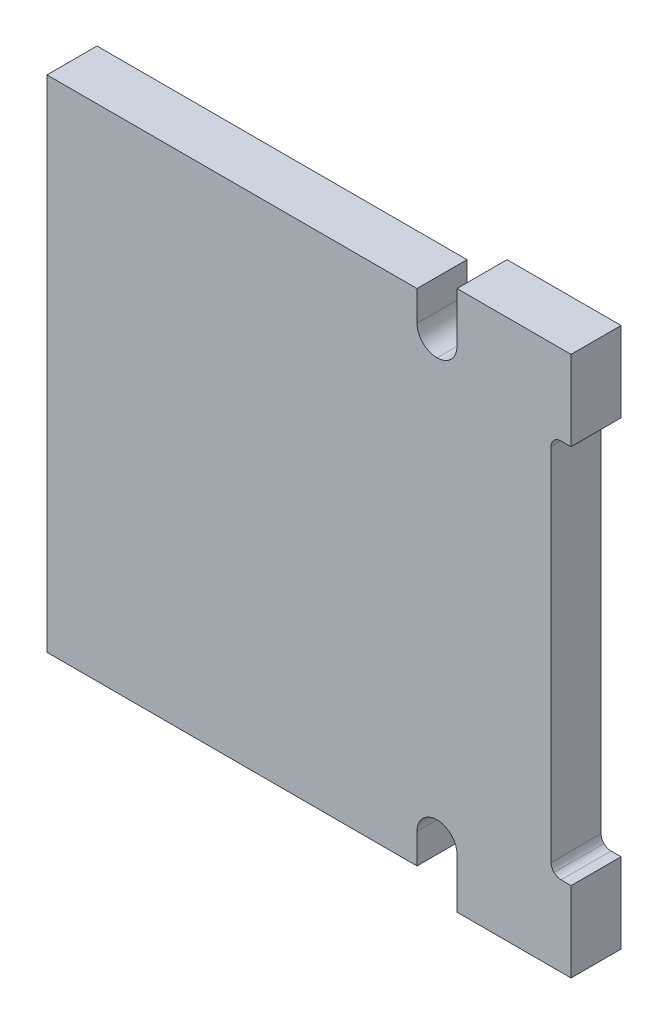
ISO-10303-21;
HEADER;
FILE_DESCRIPTION(('STEP AP214'),'2;1');
FILE_NAME('part.step','',(''),(''),'','','');
FILE_SCHEMA(('AUTOMOTIVE_DESIGN { 1 0 10303 214 1 1 1 1 }'));
ENDSEC;
DATA;
#1=APPLICATION_CONTEXT('core data for automotive mechanical design processes');
#2=APPLICATION_PROTOCOL_DEFINITION('international standard','automotive_design',2000,#1);
#3=PRODUCT_CONTEXT('',#1,'mechanical');
#4=PRODUCT('Part','Part','',(#3));
#5=PRODUCT_RELATED_PRODUCT_CATEGORY('part','',(#4));
#6=PRODUCT_DEFINITION_FORMATION('','',#4);
#7=PRODUCT_DEFINITION_CONTEXT('part definition',#1,'design');
#8=PRODUCT_DEFINITION('design','',#6,#7);
#9=PRODUCT_DEFINITION_SHAPE('','',#8);
#10=(LENGTH_UNIT() NAMED_UNIT(*) SI_UNIT(.MILLI.,.METRE.));
#11=(NAMED_UNIT(*) PLANE_ANGLE_UNIT() SI_UNIT($,.RADIAN.));
#12=(NAMED_UNIT(*) SI_UNIT($,.STERADIAN.) SOLID_ANGLE_UNIT());
#13=UNCERTAINTY_MEASURE_WITH_UNIT(LENGTH_MEASURE(1.E-05),#10,'distance_accuracy_value','');
#14=(GEOMETRIC_REPRESENTATION_CONTEXT(3) GLOBAL_UNCERTAINTY_ASSIGNED_CONTEXT((#13)) GLOBAL_UNIT_ASSIGNED_CONTEXT((#10,
#11,#12)) REPRESENTATION_CONTEXT('',''));
#15=CARTESIAN_POINT('',(0.,0.,0.));
#16=DIRECTION('',(0.,0.,1.));
#17=DIRECTION('',(1.,0.,0.));
#18=AXIS2_PLACEMENT_3D('',#15,#16,#17);
#19=CARTESIAN_POINT('',(2.5335472746525,0.,0.5));
#20=DIRECTION('',(0.,0.,1.));
#21=DIRECTION('',(1.,0.,0.));
#22=AXIS2_PLACEMENT_3D('',#19,#20,#21);
#23=PLANE('',#22);
#24=DIRECTION('',(0.,1.,0.));
#25=VECTOR('',#24,1.);
#26=CARTESIAN_POINT('',(-0.249999999999971,2.5,0.5));
#27=LINE('',#26,#25);
#28=CARTESIAN_POINT('',(-0.249999999999972,-2.50000000000011,0.5));
#29=VERTEX_POINT('',#28);
#30=CARTESIAN_POINT('',(-0.249999999999971,2.5,0.5));
#31=VERTEX_POINT('',#30);
#32=EDGE_CURVE('E316',#29,#31,#27,.T.);
#33=ORIENTED_EDGE('',*,*,#32,.F.);
#34=DIRECTION('',(-1.,0.,0.));
#35=VECTOR('',#34,1.);
#36=CARTESIAN_POINT('',(-0.249999999999972,-2.50000000000011,0.5));
#37=LINE('',#36,#35);
#38=CARTESIAN_POINT('',(3.45,-2.50000000000011,0.5));
#39=VERTEX_POINT('',#38);
#40=EDGE_CURVE('E11',#39,#29,#37,.T.);
#41=ORIENTED_EDGE('',*,*,#40,.F.);
#42=DIRECTION('',(0.,-1.,0.));
#43=VECTOR('',#42,1.);
#44=CARTESIAN_POINT('',(3.45000000000005,2.49999999999994,0.5));
#45=LINE('',#44,#43);
#46=CARTESIAN_POINT('',(3.45,-2.20000000000005,0.5));
#47=VERTEX_POINT('',#46);
#48=EDGE_CURVE('E310',#47,#39,#45,.T.);
#49=ORIENTED_EDGE('',*,*,#48,.F.);
#50=CARTESIAN_POINT('',(3.65,-2.20000000000005,0.5));
#51=DIRECTION('',(0.,0.,1.));
#52=DIRECTION('',(0.,1.,0.));
#53=AXIS2_PLACEMENT_3D('',#50,#51,#52);
#54=CIRCLE('',#53,0.199999999999989);
#55=CARTESIAN_POINT('',(3.65,-2.00000000000006,0.5));
#56=VERTEX_POINT('',#55);
#57=EDGE_CURVE('E266',#56,#47,#54,.T.);
#58=ORIENTED_EDGE('',*,*,#57,.F.);
#59=CARTESIAN_POINT('',(3.65,-2.20000000000005,0.5));
#60=DIRECTION('',(0.,0.,1.));
#61=DIRECTION('',(0.,1.,0.));
#62=AXIS2_PLACEMENT_3D('',#59,#60,#61);
#63=CIRCLE('',#62,0.199999999999989);
#64=CARTESIAN_POINT('',(3.85,-2.20000000000004,0.5));
#65=VERTEX_POINT('',#64);
#66=EDGE_CURVE('E46',#65,#56,#63,.T.);
#67=ORIENTED_EDGE('',*,*,#66,.F.);
#68=DIRECTION('',(0.,1.,0.));
#69=VECTOR('',#68,1.);
#70=CARTESIAN_POINT('',(3.85,0.999999999999772,0.5));
#71=LINE('',#70,#69);
#72=CARTESIAN_POINT('',(3.85,-2.7,0.5));
#73=VERTEX_POINT('',#72);
#74=EDGE_CURVE('E490',#73,#65,#71,.T.);
#75=ORIENTED_EDGE('',*,*,#74,.F.);
#76=DIRECTION('',(-1.,0.,0.));
#77=VECTOR('',#76,1.);
#78=CARTESIAN_POINT('',(3.85,-2.7,0.5));
#79=LINE('',#78,#77);
#80=CARTESIAN_POINT('',(4.99,-2.69999999999993,0.5));
#81=VERTEX_POINT('',#80);
#82=EDGE_CURVE('E353',#81,#73,#79,.T.);
#83=ORIENTED_EDGE('',*,*,#82,.F.);
#84=DIRECTION('',(0.,-1.,0.));
#85=VECTOR('',#84,1.);
#86=CARTESIAN_POINT('',(4.99,2.70000000000004,0.5));
#87=LINE('',#86,#85);
#88=CARTESIAN_POINT('',(4.99,-1.90000000000004,0.5));
#89=VERTEX_POINT('',#88);
#90=EDGE_CURVE('E354',#89,#81,#87,.T.);
#91=ORIENTED_EDGE('',*,*,#90,.F.);
#92=DIRECTION('',(1.,-2.84400785257291E-13,0.));
#93=VECTOR('',#92,1.);
#94=CARTESIAN_POINT('',(4.99,-1.90000000000004,0.5));
#95=LINE('',#94,#93);
#96=CARTESIAN_POINT('',(4.89,-1.9,0.5));
#97=VERTEX_POINT('',#96);
#98=EDGE_CURVE('E452',#97,#89,#95,.T.);
#99=ORIENTED_EDGE('',*,*,#98,.F.);
#100=CARTESIAN_POINT('',(4.89,-1.8,0.5));
#101=DIRECTION('',(0.,0.,1.));
#102=DIRECTION('',(-0.707106781186449,-0.707106781186646,0.));
#103=AXIS2_PLACEMENT_3D('',#100,#101,#102);
#104=CIRCLE('',#103,0.100000000000009);
#105=CARTESIAN_POINT('',(4.81928932188135,-1.87071067811867,0.5));
#106=VERTEX_POINT('',#105);
#107=EDGE_CURVE('E330',#106,#97,#104,.T.);
#108=ORIENTED_EDGE('',*,*,#107,.F.);
#109=CARTESIAN_POINT('',(4.89,-1.8,0.5));
#110=DIRECTION('',(0.,0.,1.));
#111=DIRECTION('',(-0.707106781186449,-0.707106781186646,0.));
#112=AXIS2_PLACEMENT_3D('',#109,#110,#111);
#113=CIRCLE('',#112,0.100000000000009);
#114=CARTESIAN_POINT('',(4.79,-1.8,0.5));
#115=VERTEX_POINT('',#114);
#116=EDGE_CURVE('E457',#115,#106,#113,.T.);
#117=ORIENTED_EDGE('',*,*,#116,.F.);
#118=DIRECTION('',(0.,-1.,0.));
#119=VECTOR('',#118,1.);
#120=CARTESIAN_POINT('',(4.79,-1.8,0.5));
#121=LINE('',#120,#119);
#122=CARTESIAN_POINT('',(4.79,1.79999999999995,0.5));
#123=VERTEX_POINT('',#122);
#124=EDGE_CURVE('E284',#123,#115,#121,.T.);
#125=ORIENTED_EDGE('',*,*,#124,.F.);
#126=CARTESIAN_POINT('',(4.89,1.79999999999995,0.5));
#127=DIRECTION('',(0.,0.,1.));
#128=DIRECTION('',(-0.707106781186547,0.707106781186549,0.));
#129=AXIS2_PLACEMENT_3D('',#126,#127,#128);
#130=CIRCLE('',#129,0.0999999999999942);
#131=CARTESIAN_POINT('',(4.81928932188135,1.8707106781186,0.5));
#132=VERTEX_POINT('',#131);
#133=EDGE_CURVE('E315',#132,#123,#130,.T.);
#134=ORIENTED_EDGE('',*,*,#133,.F.);
#135=CARTESIAN_POINT('',(4.89,1.79999999999995,0.5));
#136=DIRECTION('',(0.,0.,1.));
#137=DIRECTION('',(-0.707106781186547,0.707106781186549,0.));
#138=AXIS2_PLACEMENT_3D('',#135,#136,#137);
#139=CIRCLE('',#138,0.0999999999999942);
#140=CARTESIAN_POINT('',(4.89,1.89999999999995,0.5));
#141=VERTEX_POINT('',#140);
#142=EDGE_CURVE('E289',#141,#132,#139,.T.);
#143=ORIENTED_EDGE('',*,*,#142,.F.);
#144=DIRECTION('',(-1.,-2.84033403351144E-13,0.));
#145=VECTOR('',#144,1.);
#146=CARTESIAN_POINT('',(4.89,1.89999999999995,0.5));
#147=LINE('',#146,#145);
#148=CARTESIAN_POINT('',(4.99,1.9,0.5));
#149=VERTEX_POINT('',#148);
#150=EDGE_CURVE('E524',#149,#141,#147,.T.);
#151=ORIENTED_EDGE('',*,*,#150,.F.);
#152=DIRECTION('',(0.,-1.,0.));
#153=VECTOR('',#152,1.);
#154=CARTESIAN_POINT('',(4.99,1.9,0.5));
#155=LINE('',#154,#153);
#156=CARTESIAN_POINT('',(4.99,2.70000000000004,0.5));
#157=VERTEX_POINT('',#156);
#158=EDGE_CURVE('E479',#157,#149,#155,.T.);
#159=ORIENTED_EDGE('',*,*,#158,.F.);
#160=DIRECTION('',(1.,0.,0.));
#161=VECTOR('',#160,1.);
#162=CARTESIAN_POINT('',(4.99,2.70000000000004,0.5));
#163=LINE('',#162,#161);
#164=CARTESIAN_POINT('',(3.85000000000005,2.70000000000004,0.5));
#165=VERTEX_POINT('',#164);
#166=EDGE_CURVE('E394',#165,#157,#163,.T.);
#167=ORIENTED_EDGE('',*,*,#166,.F.);
#168=DIRECTION('',(0.,1.,0.));
#169=VECTOR('',#168,1.);
#170=CARTESIAN_POINT('',(3.85,0.999999999999772,0.5));
#171=LINE('',#170,#169);
#172=CARTESIAN_POINT('',(3.85,2.19999999999986,0.5));
#173=VERTEX_POINT('',#172);
#174=EDGE_CURVE('E511',#173,#165,#171,.T.);
#175=ORIENTED_EDGE('',*,*,#174,.F.);
#176=CARTESIAN_POINT('',(3.65,2.19999999999987,0.5));
#177=DIRECTION('',(0.,0.,1.));
#178=DIRECTION('',(0.,-1.,0.));
#179=AXIS2_PLACEMENT_3D('',#176,#177,#178);
#180=CIRCLE('',#179,0.200000000000003);
#181=CARTESIAN_POINT('',(3.65,1.99999999999987,0.5));
#182=VERTEX_POINT('',#181);
#183=EDGE_CURVE('E294',#182,#173,#180,.T.);
#184=ORIENTED_EDGE('',*,*,#183,.F.);
#185=CARTESIAN_POINT('',(3.65,2.19999999999987,0.5));
#186=DIRECTION('',(0.,0.,1.));
#187=DIRECTION('',(0.,-1.,0.));
#188=AXIS2_PLACEMENT_3D('',#185,#186,#187);
#189=CIRCLE('',#188,0.200000000000003);
#190=CARTESIAN_POINT('',(3.45,2.19999999999987,0.5));
#191=VERTEX_POINT('',#190);
#192=EDGE_CURVE('E414',#191,#182,#189,.T.);
#193=ORIENTED_EDGE('',*,*,#192,.F.);
#194=DIRECTION('',(0.,-1.,0.));
#195=VECTOR('',#194,1.);
#196=CARTESIAN_POINT('',(3.45,2.19999999999987,0.5));
#197=LINE('',#196,#195);
#198=CARTESIAN_POINT('',(3.45000000000005,2.49999999999994,0.5));
#199=VERTEX_POINT('',#198);
#200=EDGE_CURVE('E415',#199,#191,#197,.T.);
#201=ORIENTED_EDGE('',*,*,#200,.F.);
#202=DIRECTION('',(1.,0.,0.));
#203=VECTOR('',#202,1.);
#204=CARTESIAN_POINT('',(3.45000000000005,2.49999999999994,0.5));
#205=LINE('',#204,#203);
#206=EDGE_CURVE('E496',#31,#199,#205,.T.);
#207=ORIENTED_EDGE('',*,*,#206,.F.);
#208=EDGE_LOOP('',(#33,#41,#49,#58,#67,#75,#83,#91,#99,#108,#117,#125,#134,#143,#151,#159,#167,
#175,#184,#193,#201,#207));
#209=FACE_BOUND('',#208,.T.);
#210=ADVANCED_FACE('F17',(#209),#23,.T.);
#211=CARTESIAN_POINT('',(3.45,-2.50000000000011,0.));
#212=DIRECTION('',(0.,-1.,0.));
#213=DIRECTION('',(-1.,0.,0.));
#214=AXIS2_PLACEMENT_3D('',#211,#212,#213);
#215=PLANE('',#214);
#216=ORIENTED_EDGE('',*,*,#40,.T.);
#217=DIRECTION('',(0.,0.,1.));
#218=VECTOR('',#217,1.);
#219=CARTESIAN_POINT('',(-0.249999999999972,-2.50000000000011,0.));
#220=LINE('',#219,#218);
#221=CARTESIAN_POINT('',(-0.249999999999972,-2.50000000000011,0.));
#222=VERTEX_POINT('',#221);
#223=EDGE_CURVE('E321',#222,#29,#220,.T.);
#224=ORIENTED_EDGE('',*,*,#223,.F.);
#225=DIRECTION('',(1.,0.,0.));
#226=VECTOR('',#225,1.);
#227=CARTESIAN_POINT('',(-0.249999999999972,-2.50000000000011,0.));
#228=LINE('',#227,#226);
#229=CARTESIAN_POINT('',(3.45,-2.50000000000011,0.));
#230=VERTEX_POINT('',#229);
#231=EDGE_CURVE('E258',#222,#230,#228,.T.);
#232=ORIENTED_EDGE('',*,*,#231,.T.);
#233=DIRECTION('',(0.,0.,1.));
#234=VECTOR('',#233,1.);
#235=CARTESIAN_POINT('',(3.44999999999958,-2.50000000000011,0.));
#236=LINE('',#235,#234);
#237=EDGE_CURVE('E25',#230,#39,#236,.T.);
#238=ORIENTED_EDGE('',*,*,#237,.T.);
#239=EDGE_LOOP('',(#216,#224,#232,#238));
#240=FACE_BOUND('',#239,.T.);
#241=ADVANCED_FACE('F616',(#240),#215,.T.);
#242=CARTESIAN_POINT('',(3.45000000000005,2.49999999999994,0.));
#243=DIRECTION('',(1.,0.,0.));
#244=DIRECTION('',(0.,-1.,0.));
#245=AXIS2_PLACEMENT_3D('',#242,#243,#244);
#246=PLANE('',#245);
#247=ORIENTED_EDGE('',*,*,#48,.T.);
#248=ORIENTED_EDGE('',*,*,#237,.F.);
#249=DIRECTION('',(0.,1.,0.));
#250=VECTOR('',#249,1.);
#251=CARTESIAN_POINT('',(3.45000000000005,2.49999999999994,0.));
#252=LINE('',#251,#250);
#253=CARTESIAN_POINT('',(3.45,-2.20000000000005,0.));
#254=VERTEX_POINT('',#253);
#255=EDGE_CURVE('E247',#230,#254,#252,.T.);
#256=ORIENTED_EDGE('',*,*,#255,.T.);
#257=DIRECTION('',(0.,0.,1.));
#258=VECTOR('',#257,1.);
#259=CARTESIAN_POINT('',(3.44999999999981,-2.20000000000003,0.));
#260=LINE('',#259,#258);
#261=EDGE_CURVE('E251',#254,#47,#260,.T.);
#262=ORIENTED_EDGE('',*,*,#261,.T.);
#263=EDGE_LOOP('',(#247,#248,#256,#262));
#264=FACE_BOUND('',#263,.T.);
#265=ADVANCED_FACE('F250',(#264),#246,.T.);
#266=CARTESIAN_POINT('',(3.65,-2.20000000000005,0.));
#267=DIRECTION('',(0.,0.,1.));
#268=DIRECTION('',(0.,1.,0.));
#269=AXIS2_PLACEMENT_3D('',#266,#267,#268);
#270=CYLINDRICAL_SURFACE('',#269,0.199999999999989);
#271=DIRECTION('',(0.,0.,1.));
#272=VECTOR('',#271,1.);
#273=CARTESIAN_POINT('',(3.65,-2.00000000000006,0.));
#274=LINE('',#273,#272);
#275=CARTESIAN_POINT('',(3.65,-2.00000000000006,0.));
#276=VERTEX_POINT('',#275);
#277=EDGE_CURVE('E276',#276,#56,#274,.T.);
#278=ORIENTED_EDGE('',*,*,#277,.F.);
#279=CARTESIAN_POINT('',(3.65,-2.20000000000005,0.));
#280=DIRECTION('',(0.,0.,-1.));
#281=DIRECTION('',(0.,1.,0.));
#282=AXIS2_PLACEMENT_3D('',#279,#280,#281);
#283=CIRCLE('',#282,0.199999999999989);
#284=CARTESIAN_POINT('',(3.85,-2.20000000000004,0.));
#285=VERTEX_POINT('',#284);
#286=EDGE_CURVE('E259',#276,#285,#283,.T.);
#287=ORIENTED_EDGE('',*,*,#286,.T.);
#288=DIRECTION('',(0.,0.,1.));
#289=VECTOR('',#288,1.);
#290=CARTESIAN_POINT('',(3.85,-2.20000000000005,0.));
#291=LINE('',#290,#289);
#292=EDGE_CURVE('E311',#285,#65,#291,.T.);
#293=ORIENTED_EDGE('',*,*,#292,.T.);
#294=ORIENTED_EDGE('',*,*,#66,.T.);
#295=EDGE_LOOP('',(#278,#287,#293,#294));
#296=FACE_BOUND('',#295,.T.);
#297=ADVANCED_FACE('F554',(#296),#270,.F.);
#298=CARTESIAN_POINT('',(3.85,0.999999999999772,0.));
#299=DIRECTION('',(1.,0.,0.));
#300=DIRECTION('',(0.,-1.,0.));
#301=AXIS2_PLACEMENT_3D('',#298,#299,#300);
#302=PLANE('',#301);
#303=ORIENTED_EDGE('',*,*,#74,.T.);
#304=ORIENTED_EDGE('',*,*,#292,.F.);
#305=DIRECTION('',(0.,-1.,0.));
#306=VECTOR('',#305,1.);
#307=CARTESIAN_POINT('',(3.85,0.999999999999772,0.));
#308=LINE('',#307,#306);
#309=CARTESIAN_POINT('',(3.85,-2.7,0.));
#310=VERTEX_POINT('',#309);
#311=EDGE_CURVE('E405',#285,#310,#308,.T.);
#312=ORIENTED_EDGE('',*,*,#311,.T.);
#313=DIRECTION('',(0.,0.,1.));
#314=VECTOR('',#313,1.);
#315=CARTESIAN_POINT('',(3.85,-2.7,0.));
#316=LINE('',#315,#314);
#317=EDGE_CURVE('E486',#310,#73,#316,.T.);
#318=ORIENTED_EDGE('',*,*,#317,.T.);
#319=EDGE_LOOP('',(#303,#304,#312,#318));
#320=FACE_BOUND('',#319,.T.);
#321=ADVANCED_FACE('F556',(#320),#302,.F.);
#322=CARTESIAN_POINT('',(4.99,-2.69999999999993,0.));
#323=DIRECTION('',(0.,-1.,0.));
#324=DIRECTION('',(0.,0.,-1.));
#325=AXIS2_PLACEMENT_3D('',#322,#323,#324);
#326=PLANE('',#325);
#327=ORIENTED_EDGE('',*,*,#82,.T.);
#328=ORIENTED_EDGE('',*,*,#317,.F.);
#329=DIRECTION('',(1.,0.,0.));
#330=VECTOR('',#329,1.);
#331=CARTESIAN_POINT('',(3.85,-2.7,0.));
#332=LINE('',#331,#330);
#333=CARTESIAN_POINT('',(4.99,-2.69999999999993,0.));
#334=VERTEX_POINT('',#333);
#335=EDGE_CURVE('E376',#310,#334,#332,.T.);
#336=ORIENTED_EDGE('',*,*,#335,.T.);
#337=DIRECTION('',(0.,0.,1.));
#338=VECTOR('',#337,1.);
#339=CARTESIAN_POINT('',(4.99,-2.69999999999993,0.));
#340=LINE('',#339,#338);
#341=EDGE_CURVE('E349',#334,#81,#340,.T.);
#342=ORIENTED_EDGE('',*,*,#341,.T.);
#343=EDGE_LOOP('',(#327,#328,#336,#342));
#344=FACE_BOUND('',#343,.T.);
#345=ADVANCED_FACE('F558',(#344),#326,.T.);
#346=CARTESIAN_POINT('',(4.99,2.70000000000004,0.));
#347=DIRECTION('',(1.,0.,0.));
#348=DIRECTION('',(0.,-1.,0.));
#349=AXIS2_PLACEMENT_3D('',#346,#347,#348);
#350=PLANE('',#349);
#351=ORIENTED_EDGE('',*,*,#90,.T.);
#352=ORIENTED_EDGE('',*,*,#341,.F.);
#353=DIRECTION('',(0.,1.,0.));
#354=VECTOR('',#353,1.);
#355=CARTESIAN_POINT('',(4.99,2.70000000000004,0.));
#356=LINE('',#355,#354);
#357=CARTESIAN_POINT('',(4.99,-1.90000000000004,0.));
#358=VERTEX_POINT('',#357);
#359=EDGE_CURVE('E372',#334,#358,#356,.T.);
#360=ORIENTED_EDGE('',*,*,#359,.T.);
#361=DIRECTION('',(0.,0.,1.));
#362=VECTOR('',#361,1.);
#363=CARTESIAN_POINT('',(4.99,-1.90000000000004,0.));
#364=LINE('',#363,#362);
#365=EDGE_CURVE('E456',#358,#89,#364,.T.);
#366=ORIENTED_EDGE('',*,*,#365,.T.);
#367=EDGE_LOOP('',(#351,#352,#360,#366));
#368=FACE_BOUND('',#367,.T.);
#369=ADVANCED_FACE('F562',(#368),#350,.T.);
#370=CARTESIAN_POINT('',(4.89,-1.9,0.));
#371=DIRECTION('',(2.84400785257291E-13,1.,0.));
#372=DIRECTION('',(1.,-2.84400785257291E-13,0.));
#373=AXIS2_PLACEMENT_3D('',#370,#371,#372);
#374=PLANE('',#373);
#375=ORIENTED_EDGE('',*,*,#98,.T.);
#376=ORIENTED_EDGE('',*,*,#365,.F.);
#377=DIRECTION('',(-1.,2.84400785257291E-13,0.));
#378=VECTOR('',#377,1.);
#379=CARTESIAN_POINT('',(4.99,-1.90000000000004,0.));
#380=LINE('',#379,#378);
#381=CARTESIAN_POINT('',(4.89,-1.9,0.));
#382=VERTEX_POINT('',#381);
#383=EDGE_CURVE('E377',#358,#382,#380,.T.);
#384=ORIENTED_EDGE('',*,*,#383,.T.);
#385=DIRECTION('',(0.,0.,1.));
#386=VECTOR('',#385,1.);
#387=CARTESIAN_POINT('',(4.89,-1.9,0.));
#388=LINE('',#387,#386);
#389=EDGE_CURVE('E334',#382,#97,#388,.T.);
#390=ORIENTED_EDGE('',*,*,#389,.T.);
#391=EDGE_LOOP('',(#375,#376,#384,#390));
#392=FACE_BOUND('',#391,.T.);
#393=ADVANCED_FACE('F565',(#392),#374,.T.);
#394=CARTESIAN_POINT('',(4.89,-1.8,0.));
#395=DIRECTION('',(0.,0.,1.));
#396=DIRECTION('',(-0.707106781186449,-0.707106781186646,0.));
#397=AXIS2_PLACEMENT_3D('',#394,#395,#396);
#398=CYLINDRICAL_SURFACE('',#397,0.100000000000009);
#399=DIRECTION('',(0.,0.,1.));
#400=VECTOR('',#399,1.);
#401=CARTESIAN_POINT('',(4.81928932188135,-1.87071067811867,0.));
#402=LINE('',#401,#400);
#403=CARTESIAN_POINT('',(4.81928932188135,-1.87071067811867,0.));
#404=VERTEX_POINT('',#403);
#405=EDGE_CURVE('E306',#404,#106,#402,.T.);
#406=ORIENTED_EDGE('',*,*,#405,.F.);
#407=CARTESIAN_POINT('',(4.89,-1.8,0.));
#408=DIRECTION('',(0.,0.,-1.));
#409=DIRECTION('',(-0.707106781186449,-0.707106781186646,0.));
#410=AXIS2_PLACEMENT_3D('',#407,#408,#409);
#411=CIRCLE('',#410,0.100000000000009);
#412=CARTESIAN_POINT('',(4.79,-1.8,0.));
#413=VERTEX_POINT('',#412);
#414=EDGE_CURVE('E430',#404,#413,#411,.T.);
#415=ORIENTED_EDGE('',*,*,#414,.T.);
#416=DIRECTION('',(0.,0.,1.));
#417=VECTOR('',#416,1.);
#418=CARTESIAN_POINT('',(4.79,-1.8,0.));
#419=LINE('',#418,#417);
#420=EDGE_CURVE('E288',#413,#115,#419,.T.);
#421=ORIENTED_EDGE('',*,*,#420,.T.);
#422=ORIENTED_EDGE('',*,*,#116,.T.);
#423=EDGE_LOOP('',(#406,#415,#421,#422));
#424=FACE_BOUND('',#423,.T.);
#425=ADVANCED_FACE('F573',(#424),#398,.F.);
#426=CARTESIAN_POINT('',(4.79,1.79999999999995,0.));
#427=DIRECTION('',(1.,0.,0.));
#428=DIRECTION('',(0.,-1.,0.));
#429=AXIS2_PLACEMENT_3D('',#426,#427,#428);
#430=PLANE('',#429);
#431=ORIENTED_EDGE('',*,*,#124,.T.);
#432=ORIENTED_EDGE('',*,*,#420,.F.);
#433=DIRECTION('',(0.,1.,0.));
#434=VECTOR('',#433,1.);
#435=CARTESIAN_POINT('',(4.79,-1.8,0.));
#436=LINE('',#435,#434);
#437=CARTESIAN_POINT('',(4.79,1.79999999999995,0.));
#438=VERTEX_POINT('',#437);
#439=EDGE_CURVE('E427',#413,#438,#436,.T.);
#440=ORIENTED_EDGE('',*,*,#439,.T.);
#441=DIRECTION('',(0.,0.,1.));
#442=VECTOR('',#441,1.);
#443=CARTESIAN_POINT('',(4.79,1.79999999999995,0.));
#444=LINE('',#443,#442);
#445=EDGE_CURVE('E301',#438,#123,#444,.T.);
#446=ORIENTED_EDGE('',*,*,#445,.T.);
#447=EDGE_LOOP('',(#431,#432,#440,#446));
#448=FACE_BOUND('',#447,.T.);
#449=ADVANCED_FACE('F576',(#448),#430,.T.);
#450=CARTESIAN_POINT('',(4.89,1.79999999999995,0.));
#451=DIRECTION('',(0.,0.,1.));
#452=DIRECTION('',(-0.707106781186547,0.707106781186549,0.));
#453=AXIS2_PLACEMENT_3D('',#450,#451,#452);
#454=CYLINDRICAL_SURFACE('',#453,0.0999999999999942);
#455=DIRECTION('',(0.,0.,1.));
#456=VECTOR('',#455,1.);
#457=CARTESIAN_POINT('',(4.81928932188135,1.8707106781186,0.));
#458=LINE('',#457,#456);
#459=CARTESIAN_POINT('',(4.81928932188135,1.8707106781186,0.));
#460=VERTEX_POINT('',#459);
#461=EDGE_CURVE('E335',#460,#132,#458,.T.);
#462=ORIENTED_EDGE('',*,*,#461,.F.);
#463=CARTESIAN_POINT('',(4.89,1.79999999999995,0.));
#464=DIRECTION('',(0.,0.,-1.));
#465=DIRECTION('',(-0.707106781186547,0.707106781186549,0.));
#466=AXIS2_PLACEMENT_3D('',#463,#464,#465);
#467=CIRCLE('',#466,0.0999999999999942);
#468=CARTESIAN_POINT('',(4.89,1.89999999999995,0.));
#469=VERTEX_POINT('',#468);
#470=EDGE_CURVE('E420',#460,#469,#467,.T.);
#471=ORIENTED_EDGE('',*,*,#470,.T.);
#472=DIRECTION('',(0.,0.,1.));
#473=VECTOR('',#472,1.);
#474=CARTESIAN_POINT('',(4.89,1.89999999999995,0.));
#475=LINE('',#474,#473);
#476=EDGE_CURVE('E528',#469,#141,#475,.T.);
#477=ORIENTED_EDGE('',*,*,#476,.T.);
#478=ORIENTED_EDGE('',*,*,#142,.T.);
#479=EDGE_LOOP('',(#462,#471,#477,#478));
#480=FACE_BOUND('',#479,.T.);
#481=ADVANCED_FACE('F584',(#480),#454,.F.);
#482=CARTESIAN_POINT('',(4.99,1.9,0.));
#483=DIRECTION('',(2.84033403351144E-13,-1.,0.));
#484=DIRECTION('',(0.,0.,-1.));
#485=AXIS2_PLACEMENT_3D('',#482,#483,#484);
#486=PLANE('',#485);
#487=ORIENTED_EDGE('',*,*,#150,.T.);
#488=ORIENTED_EDGE('',*,*,#476,.F.);
#489=DIRECTION('',(1.,2.84033403351144E-13,0.));
#490=VECTOR('',#489,1.);
#491=CARTESIAN_POINT('',(4.89,1.89999999999995,0.));
#492=LINE('',#491,#490);
#493=CARTESIAN_POINT('',(4.99,1.9,0.));
#494=VERTEX_POINT('',#493);
#495=EDGE_CURVE('E416',#469,#494,#492,.T.);
#496=ORIENTED_EDGE('',*,*,#495,.T.);
#497=DIRECTION('',(0.,0.,1.));
#498=VECTOR('',#497,1.);
#499=CARTESIAN_POINT('',(4.99,1.9,0.));
#500=LINE('',#499,#498);
#501=EDGE_CURVE('E483',#494,#149,#500,.T.);
#502=ORIENTED_EDGE('',*,*,#501,.T.);
#503=EDGE_LOOP('',(#487,#488,#496,#502));
#504=FACE_BOUND('',#503,.T.);
#505=ADVANCED_FACE('F587',(#504),#486,.T.);
#506=CARTESIAN_POINT('',(4.99,2.70000000000004,0.));
#507=DIRECTION('',(1.,0.,0.));
#508=DIRECTION('',(0.,-1.,0.));
#509=AXIS2_PLACEMENT_3D('',#506,#507,#508);
#510=PLANE('',#509);
#511=ORIENTED_EDGE('',*,*,#158,.T.);
#512=ORIENTED_EDGE('',*,*,#501,.F.);
#513=DIRECTION('',(0.,1.,0.));
#514=VECTOR('',#513,1.);
#515=CARTESIAN_POINT('',(4.99,1.9,0.));
#516=LINE('',#515,#514);
#517=CARTESIAN_POINT('',(4.99,2.70000000000004,0.));
#518=VERTEX_POINT('',#517);
#519=EDGE_CURVE('E409',#494,#518,#516,.T.);
#520=ORIENTED_EDGE('',*,*,#519,.T.);
#521=DIRECTION('',(0.,0.,1.));
#522=VECTOR('',#521,1.);
#523=CARTESIAN_POINT('',(4.99,2.70000000000004,0.));
#524=LINE('',#523,#522);
#525=EDGE_CURVE('E398',#518,#157,#524,.T.);
#526=ORIENTED_EDGE('',*,*,#525,.T.);
#527=EDGE_LOOP('',(#511,#512,#520,#526));
#528=FACE_BOUND('',#527,.T.);
#529=ADVANCED_FACE('F589',(#528),#510,.T.);
#530=CARTESIAN_POINT('',(3.85000000000005,2.70000000000004,0.));
#531=DIRECTION('',(0.,1.,0.));
#532=DIRECTION('',(1.,0.,0.));
#533=AXIS2_PLACEMENT_3D('',#530,#531,#532);
#534=PLANE('',#533);
#535=ORIENTED_EDGE('',*,*,#166,.T.);
#536=ORIENTED_EDGE('',*,*,#525,.F.);
#537=DIRECTION('',(-1.,0.,0.));
#538=VECTOR('',#537,1.);
#539=CARTESIAN_POINT('',(4.99,2.70000000000004,0.));
#540=LINE('',#539,#538);
#541=CARTESIAN_POINT('',(3.85000000000005,2.70000000000004,0.));
#542=VERTEX_POINT('',#541);
#543=EDGE_CURVE('E402',#518,#542,#540,.T.);
#544=ORIENTED_EDGE('',*,*,#543,.T.);
#545=DIRECTION('',(0.,0.,1.));
#546=VECTOR('',#545,1.);
#547=CARTESIAN_POINT('',(3.85,2.70000000000004,0.));
#548=LINE('',#547,#546);
#549=EDGE_CURVE('E399',#542,#165,#548,.T.);
#550=ORIENTED_EDGE('',*,*,#549,.T.);
#551=EDGE_LOOP('',(#535,#536,#544,#550));
#552=FACE_BOUND('',#551,.T.);
#553=ADVANCED_FACE('F593',(#552),#534,.T.);
#554=CARTESIAN_POINT('',(3.85,0.999999999999772,0.));
#555=DIRECTION('',(1.,0.,0.));
#556=DIRECTION('',(0.,-1.,0.));
#557=AXIS2_PLACEMENT_3D('',#554,#555,#556);
#558=PLANE('',#557);
#559=ORIENTED_EDGE('',*,*,#174,.T.);
#560=ORIENTED_EDGE('',*,*,#549,.F.);
#561=DIRECTION('',(0.,-1.,0.));
#562=VECTOR('',#561,1.);
#563=CARTESIAN_POINT('',(3.85,0.999999999999772,0.));
#564=LINE('',#563,#562);
#565=CARTESIAN_POINT('',(3.85,2.19999999999986,0.));
#566=VERTEX_POINT('',#565);
#567=EDGE_CURVE('E393',#542,#566,#564,.T.);
#568=ORIENTED_EDGE('',*,*,#567,.T.);
#569=DIRECTION('',(0.,0.,1.));
#570=VECTOR('',#569,1.);
#571=CARTESIAN_POINT('',(3.85,2.19999999999987,0.));
#572=LINE('',#571,#570);
#573=EDGE_CURVE('E290',#566,#173,#572,.T.);
#574=ORIENTED_EDGE('',*,*,#573,.T.);
#575=EDGE_LOOP('',(#559,#560,#568,#574));
#576=FACE_BOUND('',#575,.T.);
#577=ADVANCED_FACE('F596',(#576),#558,.F.);
#578=CARTESIAN_POINT('',(3.65,2.19999999999987,0.));
#579=DIRECTION('',(0.,0.,1.));
#580=DIRECTION('',(0.,-1.,0.));
#581=AXIS2_PLACEMENT_3D('',#578,#579,#580);
#582=CYLINDRICAL_SURFACE('',#581,0.200000000000003);
#583=DIRECTION('',(0.,0.,1.));
#584=VECTOR('',#583,1.);
#585=CARTESIAN_POINT('',(3.65,1.99999999999987,0.));
#586=LINE('',#585,#584);
#587=CARTESIAN_POINT('',(3.65,1.99999999999987,0.));
#588=VERTEX_POINT('',#587);
#589=EDGE_CURVE('E300',#588,#182,#586,.T.);
#590=ORIENTED_EDGE('',*,*,#589,.F.);
#591=CARTESIAN_POINT('',(3.65,2.19999999999987,0.));
#592=DIRECTION('',(0.,0.,-1.));
#593=DIRECTION('',(0.,-1.,0.));
#594=AXIS2_PLACEMENT_3D('',#591,#592,#593);
#595=CIRCLE('',#594,0.200000000000003);
#596=CARTESIAN_POINT('',(3.45,2.19999999999987,0.));
#597=VERTEX_POINT('',#596);
#598=EDGE_CURVE('E389',#588,#597,#595,.T.);
#599=ORIENTED_EDGE('',*,*,#598,.T.);
#600=DIRECTION('',(0.,0.,1.));
#601=VECTOR('',#600,1.);
#602=CARTESIAN_POINT('',(3.45,2.19999999999987,0.));
#603=LINE('',#602,#601);
#604=EDGE_CURVE('E410',#597,#191,#603,.T.);
#605=ORIENTED_EDGE('',*,*,#604,.T.);
#606=ORIENTED_EDGE('',*,*,#192,.T.);
#607=EDGE_LOOP('',(#590,#599,#605,#606));
#608=FACE_BOUND('',#607,.T.);
#609=ADVANCED_FACE('F604',(#608),#582,.F.);
#610=CARTESIAN_POINT('',(3.45000000000005,2.49999999999994,0.));
#611=DIRECTION('',(1.,0.,0.));
#612=DIRECTION('',(0.,-1.,0.));
#613=AXIS2_PLACEMENT_3D('',#610,#611,#612);
#614=PLANE('',#613);
#615=ORIENTED_EDGE('',*,*,#200,.T.);
#616=ORIENTED_EDGE('',*,*,#604,.F.);
#617=DIRECTION('',(0.,1.,0.));
#618=VECTOR('',#617,1.);
#619=CARTESIAN_POINT('',(3.45,2.19999999999987,0.));
#620=LINE('',#619,#618);
#621=CARTESIAN_POINT('',(3.45000000000005,2.49999999999994,0.));
#622=VERTEX_POINT('',#621);
#623=EDGE_CURVE('E385',#597,#622,#620,.T.);
#624=ORIENTED_EDGE('',*,*,#623,.T.);
#625=DIRECTION('',(0.,0.,1.));
#626=VECTOR('',#625,1.);
#627=CARTESIAN_POINT('',(3.45000000000005,2.49999999999994,0.));
#628=LINE('',#627,#626);
#629=EDGE_CURVE('E502',#622,#199,#628,.T.);
#630=ORIENTED_EDGE('',*,*,#629,.T.);
#631=EDGE_LOOP('',(#615,#616,#624,#630));
#632=FACE_BOUND('',#631,.T.);
#633=ADVANCED_FACE('F607',(#632),#614,.T.);
#634=CARTESIAN_POINT('',(-0.249999999999971,2.5,0.));
#635=DIRECTION('',(0.,1.,0.));
#636=DIRECTION('',(1.,0.,0.));
#637=AXIS2_PLACEMENT_3D('',#634,#635,#636);
#638=PLANE('',#637);
#639=ORIENTED_EDGE('',*,*,#206,.T.);
#640=ORIENTED_EDGE('',*,*,#629,.F.);
#641=DIRECTION('',(-1.,0.,0.));
#642=VECTOR('',#641,1.);
#643=CARTESIAN_POINT('',(3.45000000000005,2.49999999999994,0.));
#644=LINE('',#643,#642);
#645=CARTESIAN_POINT('',(-0.249999999999971,2.5,0.));
#646=VERTEX_POINT('',#645);
#647=EDGE_CURVE('E381',#622,#646,#644,.T.);
#648=ORIENTED_EDGE('',*,*,#647,.T.);
#649=DIRECTION('',(0.,0.,1.));
#650=VECTOR('',#649,1.);
#651=CARTESIAN_POINT('',(-0.249999999999971,2.5,0.));
#652=LINE('',#651,#650);
#653=EDGE_CURVE('E320',#646,#31,#652,.T.);
#654=ORIENTED_EDGE('',*,*,#653,.T.);
#655=EDGE_LOOP('',(#639,#640,#648,#654));
#656=FACE_BOUND('',#655,.T.);
#657=ADVANCED_FACE('F609',(#656),#638,.T.);
#658=CARTESIAN_POINT('',(-0.249999999999972,-2.50000000000011,0.));
#659=DIRECTION('',(-1.,0.,0.));
#660=DIRECTION('',(0.,0.,1.));
#661=AXIS2_PLACEMENT_3D('',#658,#659,#660);
#662=PLANE('',#661);
#663=DIRECTION('',(0.,0.,1.));
#664=VECTOR('',#663,1.);
#665=CARTESIAN_POINT('',(-0.249999999999972,0.499999999999943,0.));
#666=LINE('',#665,#664);
#667=CARTESIAN_POINT('',(-0.249999999999972,0.499999999999943,0.));
#668=VERTEX_POINT('',#667);
#669=CARTESIAN_POINT('',(-0.249999999999972,0.499999999999943,0.03));
#670=VERTEX_POINT('',#669);
#671=EDGE_CURVE('E340',#668,#670,#666,.T.);
#672=ORIENTED_EDGE('',*,*,#671,.T.);
#673=DIRECTION('',(0.,-1.,0.));
#674=VECTOR('',#673,1.);
#675=CARTESIAN_POINT('',(-0.249999999999972,-1.25000000000009,0.03));
#676=LINE('',#675,#674);
#677=CARTESIAN_POINT('',(-0.249999999999972,-0.500000000000057,0.03));
#678=VERTEX_POINT('',#677);
#679=EDGE_CURVE('E442',#670,#678,#676,.T.);
#680=ORIENTED_EDGE('',*,*,#679,.T.);
#681=DIRECTION('',(0.,0.,-1.));
#682=VECTOR('',#681,1.);
#683=CARTESIAN_POINT('',(-0.249999999999972,-0.500000000000057,0.));
#684=LINE('',#683,#682);
#685=CARTESIAN_POINT('',(-0.249999999999972,-0.500000000000057,0.));
#686=VERTEX_POINT('',#685);
#687=EDGE_CURVE('E469',#678,#686,#684,.T.);
#688=ORIENTED_EDGE('',*,*,#687,.T.);
#689=DIRECTION('',(0.,-1.,0.));
#690=VECTOR('',#689,1.);
#691=CARTESIAN_POINT('',(-0.249999999999971,2.5,0.));
#692=LINE('',#691,#690);
#693=EDGE_CURVE('E322',#686,#222,#692,.T.);
#694=ORIENTED_EDGE('',*,*,#693,.T.);
#695=ORIENTED_EDGE('',*,*,#223,.T.);
#696=ORIENTED_EDGE('',*,*,#32,.T.);
#697=ORIENTED_EDGE('',*,*,#653,.F.);
#698=DIRECTION('',(0.,-1.,0.));
#699=VECTOR('',#698,1.);
#700=CARTESIAN_POINT('',(-0.249999999999971,2.5,0.));
#701=LINE('',#700,#699);
#702=EDGE_CURVE('E369',#646,#668,#701,.T.);
#703=ORIENTED_EDGE('',*,*,#702,.T.);
#704=EDGE_LOOP('',(#672,#680,#688,#694,#695,#696,#697,#703));
#705=FACE_BOUND('',#704,.T.);
#706=ADVANCED_FACE('F613',(#705),#662,.T.);
#707=CARTESIAN_POINT('',(-0.0999999999999091,0.,0.03));
#708=DIRECTION('',(0.,0.,1.));
#709=DIRECTION('',(1.,0.,0.));
#710=AXIS2_PLACEMENT_3D('',#707,#708,#709);
#711=PLANE('',#710);
#712=DIRECTION('',(-1.,0.,0.));
#713=VECTOR('',#712,1.);
#714=CARTESIAN_POINT('',(0.0500000000001534,-0.500000000000057,0.03));
#715=LINE('',#714,#713);
#716=CARTESIAN_POINT('',(0.0500000000001534,-0.500000000000057,0.03));
#717=VERTEX_POINT('',#716);
#718=EDGE_CURVE('E443',#717,#678,#715,.T.);
#719=ORIENTED_EDGE('',*,*,#718,.T.);
#720=ORIENTED_EDGE('',*,*,#679,.F.);
#721=DIRECTION('',(1.,0.,0.));
#722=VECTOR('',#721,1.);
#723=CARTESIAN_POINT('',(-0.249999999999972,0.499999999999943,0.03));
#724=LINE('',#723,#722);
#725=CARTESIAN_POINT('',(0.0500000000001536,0.499999999999943,0.03));
#726=VERTEX_POINT('',#725);
#727=EDGE_CURVE('E345',#670,#726,#724,.T.);
#728=ORIENTED_EDGE('',*,*,#727,.T.);
#729=DIRECTION('',(0.,-1.,0.));
#730=VECTOR('',#729,1.);
#731=CARTESIAN_POINT('',(0.0500000000001536,0.499999999999943,0.03));
#732=LINE('',#731,#730);
#733=EDGE_CURVE('E478',#726,#717,#732,.T.);
#734=ORIENTED_EDGE('',*,*,#733,.T.);
#735=EDGE_LOOP('',(#719,#720,#728,#734));
#736=FACE_BOUND('',#735,.T.);
#737=ADVANCED_FACE('F630',(#736),#711,.F.);
#738=CARTESIAN_POINT('',(0.0500000000001536,0.499999999999943,0.));
#739=DIRECTION('',(1.,0.,0.));
#740=DIRECTION('',(0.,-1.,0.));
#741=AXIS2_PLACEMENT_3D('',#738,#739,#740);
#742=PLANE('',#741);
#743=ORIENTED_EDGE('',*,*,#733,.F.);
#744=DIRECTION('',(0.,0.,1.));
#745=VECTOR('',#744,1.);
#746=CARTESIAN_POINT('',(0.0500000000001536,0.499999999999943,0.));
#747=LINE('',#746,#745);
#748=CARTESIAN_POINT('',(0.0500000000001536,0.499999999999943,0.));
#749=VERTEX_POINT('',#748);
#750=EDGE_CURVE('E344',#749,#726,#747,.T.);
#751=ORIENTED_EDGE('',*,*,#750,.F.);
#752=DIRECTION('',(0.,1.,0.));
#753=VECTOR('',#752,1.);
#754=CARTESIAN_POINT('',(0.0500000000001535,0.249999999999971,0.));
#755=LINE('',#754,#753);
#756=CARTESIAN_POINT('',(0.0500000000001534,-0.500000000000057,0.));
#757=VERTEX_POINT('',#756);
#758=EDGE_CURVE('E448',#757,#749,#755,.T.);
#759=ORIENTED_EDGE('',*,*,#758,.F.);
#760=DIRECTION('',(0.,0.,1.));
#761=VECTOR('',#760,1.);
#762=CARTESIAN_POINT('',(0.0500000000001534,-0.500000000000057,0.));
#763=LINE('',#762,#761);
#764=EDGE_CURVE('E447',#757,#717,#763,.T.);
#765=ORIENTED_EDGE('',*,*,#764,.T.);
#766=EDGE_LOOP('',(#743,#751,#759,#765));
#767=FACE_BOUND('',#766,.T.);
#768=ADVANCED_FACE('F625',(#767),#742,.F.);
#769=CARTESIAN_POINT('',(-0.249999999999972,0.499999999999943,0.));
#770=DIRECTION('',(0.,1.,0.));
#771=DIRECTION('',(1.,0.,0.));
#772=AXIS2_PLACEMENT_3D('',#769,#770,#771);
#773=PLANE('',#772);
#774=ORIENTED_EDGE('',*,*,#727,.F.);
#775=ORIENTED_EDGE('',*,*,#671,.F.);
#776=DIRECTION('',(-1.,0.,0.));
#777=VECTOR('',#776,1.);
#778=CARTESIAN_POINT('',(1.14177363732626,0.499999999999943,0.));
#779=LINE('',#778,#777);
#780=EDGE_CURVE('E293',#749,#668,#779,.T.);
#781=ORIENTED_EDGE('',*,*,#780,.F.);
#782=ORIENTED_EDGE('',*,*,#750,.T.);
#783=EDGE_LOOP('',(#774,#775,#781,#782));
#784=FACE_BOUND('',#783,.T.);
#785=ADVANCED_FACE('F628',(#784),#773,.F.);
#786=CARTESIAN_POINT('',(0.0500000000001534,-0.500000000000057,0.));
#787=DIRECTION('',(0.,-1.,0.));
#788=DIRECTION('',(-1.,0.,0.));
#789=AXIS2_PLACEMENT_3D('',#786,#787,#788);
#790=PLANE('',#789);
#791=ORIENTED_EDGE('',*,*,#718,.F.);
#792=ORIENTED_EDGE('',*,*,#764,.F.);
#793=DIRECTION('',(1.,0.,0.));
#794=VECTOR('',#793,1.);
#795=CARTESIAN_POINT('',(1.29177363732633,-0.500000000000057,0.));
#796=LINE('',#795,#794);
#797=EDGE_CURVE('E326',#686,#757,#796,.T.);
#798=ORIENTED_EDGE('',*,*,#797,.F.);
#799=ORIENTED_EDGE('',*,*,#687,.F.);
#800=EDGE_LOOP('',(#791,#792,#798,#799));
#801=FACE_BOUND('',#800,.T.);
#802=ADVANCED_FACE('F623',(#801),#790,.F.);
#803=CARTESIAN_POINT('',(3.55,-1.85369262646966E-13,0.));
#804=DIRECTION('',(0.,0.,1.));
#805=DIRECTION('',(1.,0.,0.));
#806=AXIS2_PLACEMENT_3D('',#803,#804,#805);
#807=PLANE('',#806);
#808=ORIENTED_EDGE('',*,*,#780,.T.);
#809=ORIENTED_EDGE('',*,*,#702,.F.);
#810=ORIENTED_EDGE('',*,*,#647,.F.);
#811=ORIENTED_EDGE('',*,*,#623,.F.);
#812=ORIENTED_EDGE('',*,*,#598,.F.);
#813=CARTESIAN_POINT('',(3.65,2.19999999999987,0.));
#814=DIRECTION('',(0.,0.,-1.));
#815=DIRECTION('',(0.,-1.,0.));
#816=AXIS2_PLACEMENT_3D('',#813,#814,#815);
#817=CIRCLE('',#816,0.200000000000003);
#818=EDGE_CURVE('E296',#566,#588,#817,.T.);
#819=ORIENTED_EDGE('',*,*,#818,.F.);
#820=ORIENTED_EDGE('',*,*,#567,.F.);
#821=ORIENTED_EDGE('',*,*,#543,.F.);
#822=ORIENTED_EDGE('',*,*,#519,.F.);
#823=ORIENTED_EDGE('',*,*,#495,.F.);
#824=ORIENTED_EDGE('',*,*,#470,.F.);
#825=CARTESIAN_POINT('',(4.89,1.79999999999995,0.));
#826=DIRECTION('',(0.,0.,-1.));
#827=DIRECTION('',(-0.707106781186547,0.707106781186549,0.));
#828=AXIS2_PLACEMENT_3D('',#825,#826,#827);
#829=CIRCLE('',#828,0.0999999999999942);
#830=EDGE_CURVE('E339',#438,#460,#829,.T.);
#831=ORIENTED_EDGE('',*,*,#830,.F.);
#832=ORIENTED_EDGE('',*,*,#439,.F.);
#833=ORIENTED_EDGE('',*,*,#414,.F.);
#834=CARTESIAN_POINT('',(4.89,-1.8,0.));
#835=DIRECTION('',(0.,0.,-1.));
#836=DIRECTION('',(-0.707106781186449,-0.707106781186646,0.));
#837=AXIS2_PLACEMENT_3D('',#834,#835,#836);
#838=CIRCLE('',#837,0.100000000000009);
#839=EDGE_CURVE('E268',#382,#404,#838,.T.);
#840=ORIENTED_EDGE('',*,*,#839,.F.);
#841=ORIENTED_EDGE('',*,*,#383,.F.);
#842=ORIENTED_EDGE('',*,*,#359,.F.);
#843=ORIENTED_EDGE('',*,*,#335,.F.);
#844=ORIENTED_EDGE('',*,*,#311,.F.);
#845=ORIENTED_EDGE('',*,*,#286,.F.);
#846=CARTESIAN_POINT('',(3.65,-2.20000000000005,0.));
#847=DIRECTION('',(0.,0.,-1.));
#848=DIRECTION('',(0.,1.,0.));
#849=AXIS2_PLACEMENT_3D('',#846,#847,#848);
#850=CIRCLE('',#849,0.199999999999989);
#851=EDGE_CURVE('E265',#254,#276,#850,.T.);
#852=ORIENTED_EDGE('',*,*,#851,.F.);
#853=ORIENTED_EDGE('',*,*,#255,.F.);
#854=ORIENTED_EDGE('',*,*,#231,.F.);
#855=ORIENTED_EDGE('',*,*,#693,.F.);
#856=ORIENTED_EDGE('',*,*,#797,.T.);
#857=ORIENTED_EDGE('',*,*,#758,.T.);
#858=EDGE_LOOP('',(#808,#809,#810,#811,#812,#819,#820,#821,#822,#823,#824,#831,#832,#833,#840,
#841,#842,#843,#844,#845,#852,#853,#854,#855,#856,#857));
#859=FACE_BOUND('',#858,.T.);
#860=ADVANCED_FACE('F271',(#859),#807,.F.);
#861=CARTESIAN_POINT('',(3.65,2.19999999999987,0.));
#862=DIRECTION('',(0.,0.,1.));
#863=DIRECTION('',(0.,-1.,0.));
#864=AXIS2_PLACEMENT_3D('',#861,#862,#863);
#865=CYLINDRICAL_SURFACE('',#864,0.200000000000003);
#866=ORIENTED_EDGE('',*,*,#818,.T.);
#867=ORIENTED_EDGE('',*,*,#589,.T.);
#868=ORIENTED_EDGE('',*,*,#183,.T.);
#869=ORIENTED_EDGE('',*,*,#573,.F.);
#870=EDGE_LOOP('',(#866,#867,#868,#869));
#871=FACE_BOUND('',#870,.T.);
#872=ADVANCED_FACE('F601',(#871),#865,.F.);
#873=CARTESIAN_POINT('',(4.89,1.79999999999995,0.));
#874=DIRECTION('',(0.,0.,1.));
#875=DIRECTION('',(-0.707106781186547,0.707106781186549,0.));
#876=AXIS2_PLACEMENT_3D('',#873,#874,#875);
#877=CYLINDRICAL_SURFACE('',#876,0.0999999999999942);
#878=ORIENTED_EDGE('',*,*,#830,.T.);
#879=ORIENTED_EDGE('',*,*,#461,.T.);
#880=ORIENTED_EDGE('',*,*,#133,.T.);
#881=ORIENTED_EDGE('',*,*,#445,.F.);
#882=EDGE_LOOP('',(#878,#879,#880,#881));
#883=FACE_BOUND('',#882,.T.);
#884=ADVANCED_FACE('F581',(#883),#877,.F.);
#885=CARTESIAN_POINT('',(4.89,-1.8,0.));
#886=DIRECTION('',(0.,0.,1.));
#887=DIRECTION('',(-0.707106781186449,-0.707106781186646,0.));
#888=AXIS2_PLACEMENT_3D('',#885,#886,#887);
#889=CYLINDRICAL_SURFACE('',#888,0.100000000000009);
#890=ORIENTED_EDGE('',*,*,#839,.T.);
#891=ORIENTED_EDGE('',*,*,#405,.T.);
#892=ORIENTED_EDGE('',*,*,#107,.T.);
#893=ORIENTED_EDGE('',*,*,#389,.F.);
#894=EDGE_LOOP('',(#890,#891,#892,#893));
#895=FACE_BOUND('',#894,.T.);
#896=ADVANCED_FACE('F570',(#895),#889,.F.);
#897=CARTESIAN_POINT('',(3.65,-2.20000000000005,0.));
#898=DIRECTION('',(0.,0.,1.));
#899=DIRECTION('',(0.,1.,0.));
#900=AXIS2_PLACEMENT_3D('',#897,#898,#899);
#901=CYLINDRICAL_SURFACE('',#900,0.199999999999989);
#902=ORIENTED_EDGE('',*,*,#851,.T.);
#903=ORIENTED_EDGE('',*,*,#277,.T.);
#904=ORIENTED_EDGE('',*,*,#57,.T.);
#905=ORIENTED_EDGE('',*,*,#261,.F.);
#906=EDGE_LOOP('',(#902,#903,#904,#905));
#907=FACE_BOUND('',#906,.T.);
#908=ADVANCED_FACE('F263',(#907),#901,.F.);
#909=CLOSED_SHELL('',(#210,#241,#265,#297,#321,#345,#369,#393,#425,#449,#481,#505,#529,#553,
#577,#609,#633,#657,#706,#737,#768,#785,#802,#860,#872,#884,#896,#908));
#910=MANIFOLD_SOLID_BREP('B1',#909);
#911=ADVANCED_BREP_SHAPE_REPRESENTATION('',(#18,#910),#14);
#912=SHAPE_DEFINITION_REPRESENTATION(#9,#911);
ENDSEC;
END-ISO-10303-21;
